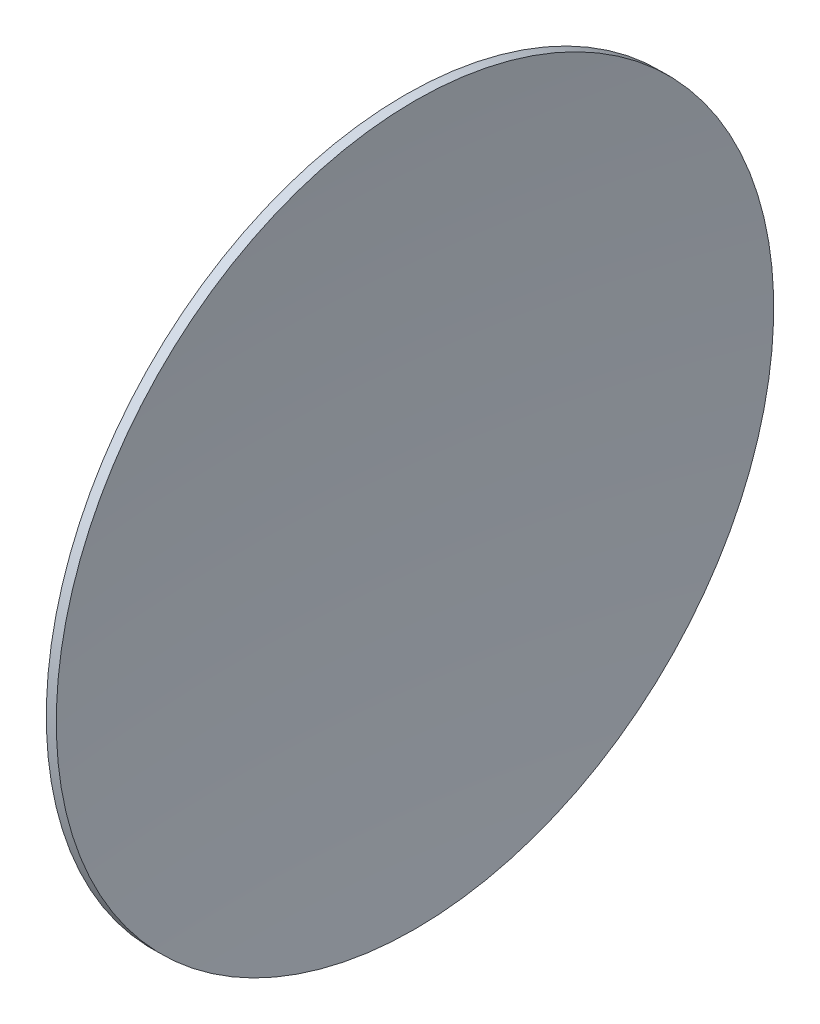
ISO-10303-21;
HEADER;
FILE_DESCRIPTION(('STEP AP214'),'2;1');
FILE_NAME('part.step','',(''),(''),'','','');
FILE_SCHEMA(('AUTOMOTIVE_DESIGN { 1 0 10303 214 1 1 1 1 }'));
ENDSEC;
DATA;
#1=APPLICATION_CONTEXT('core data for automotive mechanical design processes');
#2=APPLICATION_PROTOCOL_DEFINITION('international standard','automotive_design',2000,#1);
#3=PRODUCT_CONTEXT('',#1,'mechanical');
#4=PRODUCT('Part','Part','',(#3));
#5=PRODUCT_RELATED_PRODUCT_CATEGORY('part','',(#4));
#6=PRODUCT_DEFINITION_FORMATION('','',#4);
#7=PRODUCT_DEFINITION_CONTEXT('part definition',#1,'design');
#8=PRODUCT_DEFINITION('design','',#6,#7);
#9=PRODUCT_DEFINITION_SHAPE('','',#8);
#10=(LENGTH_UNIT() NAMED_UNIT(*) SI_UNIT(.MILLI.,.METRE.));
#11=(NAMED_UNIT(*) PLANE_ANGLE_UNIT() SI_UNIT($,.RADIAN.));
#12=(NAMED_UNIT(*) SI_UNIT($,.STERADIAN.) SOLID_ANGLE_UNIT());
#13=UNCERTAINTY_MEASURE_WITH_UNIT(LENGTH_MEASURE(1.E-05),#10,'distance_accuracy_value','');
#14=(GEOMETRIC_REPRESENTATION_CONTEXT(3) GLOBAL_UNCERTAINTY_ASSIGNED_CONTEXT((#13)) GLOBAL_UNIT_ASSIGNED_CONTEXT((#10,
#11,#12)) REPRESENTATION_CONTEXT('',''));
#15=CARTESIAN_POINT('',(0.,0.,0.));
#16=DIRECTION('',(0.,0.,1.));
#17=DIRECTION('',(1.,0.,0.));
#18=AXIS2_PLACEMENT_3D('',#15,#16,#17);
#19=CARTESIAN_POINT('',(164.061472779838,5.18506556386455,0.));
#20=DIRECTION('',(1.,0.,0.));
#21=DIRECTION('',(0.,-1.,0.));
#22=AXIS2_PLACEMENT_3D('',#19,#20,#21);
#23=SPHERICAL_SURFACE('',#22,181.954141935959);
#24=CARTESIAN_POINT('',(-16.995417100592,5.18506556386459,0.));
#25=DIRECTION('',(1.,0.,0.));
#26=DIRECTION('',(0.,1.,0.));
#27=AXIS2_PLACEMENT_3D('',#24,#25,#26);
#28=CIRCLE('',#27,18.0475038295279);
#29=CARTESIAN_POINT('',(-16.9954171005917,23.2325693933925,0.));
#30=VERTEX_POINT('',#29);
#31=EDGE_CURVE('E10',#30,#30,#28,.T.);
#32=ORIENTED_EDGE('',*,*,#31,.T.);
#33=EDGE_LOOP('',(#32));
#34=FACE_BOUND('',#33,.T.);
#35=ADVANCED_FACE('F30',(#34),#23,.F.);
#36=CARTESIAN_POINT('',(-14.4954171005917,5.18506556386455,0.));
#37=DIRECTION('',(1.,0.,0.));
#38=DIRECTION('',(0.,1.,0.));
#39=AXIS2_PLACEMENT_3D('',#36,#37,#38);
#40=CYLINDRICAL_SURFACE('',#39,18.0475038295279);
#41=CARTESIAN_POINT('',(-17.4978880780096,5.1850655638646,0.));
#42=DIRECTION('',(1.,0.,0.));
#43=DIRECTION('',(0.,1.,0.));
#44=AXIS2_PLACEMENT_3D('',#41,#42,#43);
#45=CIRCLE('',#44,18.0475038295279);
#46=CARTESIAN_POINT('',(-17.4978880780093,23.2325693933925,0.));
#47=VERTEX_POINT('',#46);
#48=EDGE_CURVE('E36',#47,#47,#45,.T.);
#49=ORIENTED_EDGE('',*,*,#48,.T.);
#50=EDGE_LOOP('',(#49));
#51=FACE_BOUND('',#50,.T.);
#52=ORIENTED_EDGE('',*,*,#31,.F.);
#53=EDGE_LOOP('',(#52));
#54=FACE_BOUND('',#53,.T.);
#55=ADVANCED_FACE('F42',(#51,#54),#40,.T.);
#56=CARTESIAN_POINT('',(164.061472779838,5.18506556386455,0.));
#57=DIRECTION('',(1.,0.,0.));
#58=DIRECTION('',(0.,1.,0.));
#59=AXIS2_PLACEMENT_3D('',#56,#57,#58);
#60=SPHERICAL_SURFACE('',#59,182.454141935959);
#61=ORIENTED_EDGE('',*,*,#48,.F.);
#62=EDGE_LOOP('',(#61));
#63=FACE_BOUND('',#62,.T.);
#64=ADVANCED_FACE('F45',(#63),#60,.T.);
#65=CLOSED_SHELL('',(#35,#55,#64));
#66=MANIFOLD_SOLID_BREP('B2',#65);
#67=ADVANCED_BREP_SHAPE_REPRESENTATION('',(#18,#66),#14);
#68=SHAPE_DEFINITION_REPRESENTATION(#9,#67);
ENDSEC;
END-ISO-10303-21;
